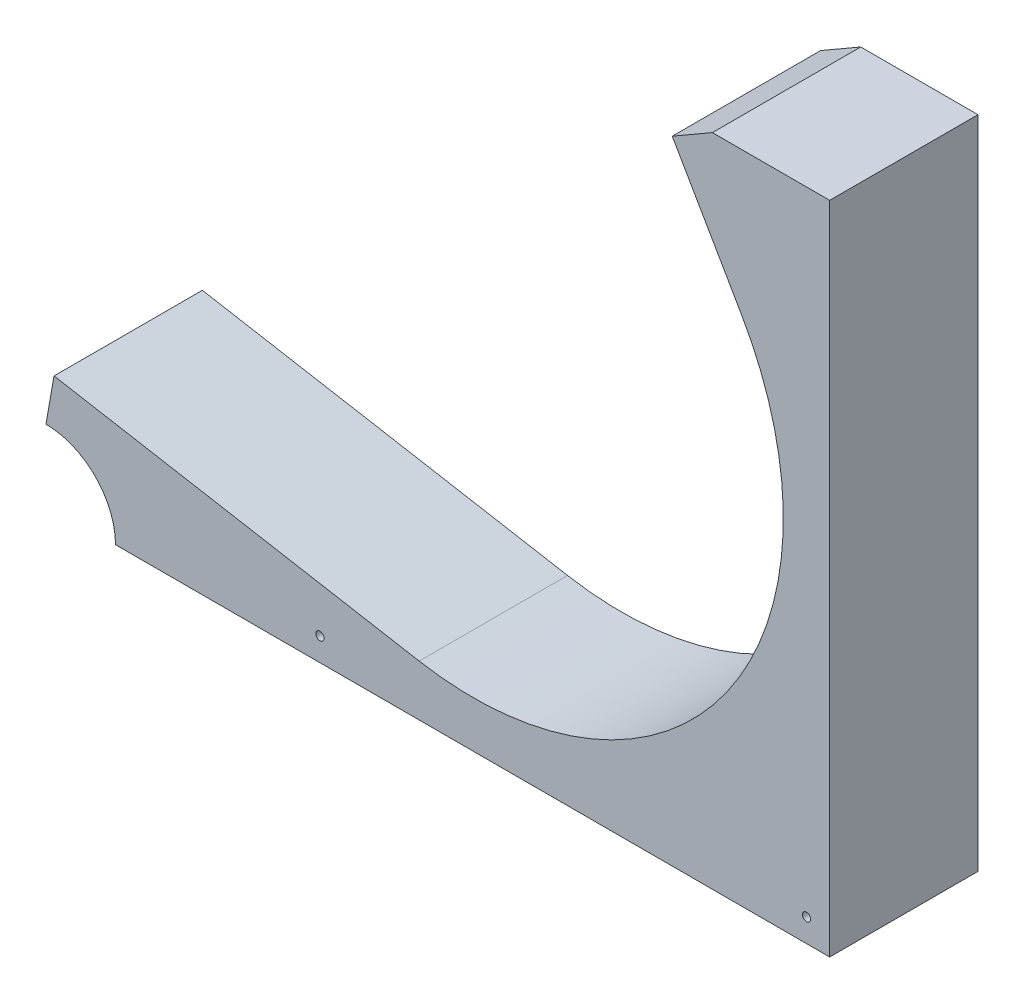
ISO-10303-21;
HEADER;
FILE_DESCRIPTION(('STEP AP214'),'2;1');
FILE_NAME('part.step','',(''),(''),'','','');
FILE_SCHEMA(('AUTOMOTIVE_DESIGN { 1 0 10303 214 1 1 1 1 }'));
ENDSEC;
DATA;
#1=APPLICATION_CONTEXT('core data for automotive mechanical design processes');
#2=APPLICATION_PROTOCOL_DEFINITION('international standard','automotive_design',2000,#1);
#3=PRODUCT_CONTEXT('',#1,'mechanical');
#4=PRODUCT('Part','Part','',(#3));
#5=PRODUCT_RELATED_PRODUCT_CATEGORY('part','',(#4));
#6=PRODUCT_DEFINITION_FORMATION('','',#4);
#7=PRODUCT_DEFINITION_CONTEXT('part definition',#1,'design');
#8=PRODUCT_DEFINITION('design','',#6,#7);
#9=PRODUCT_DEFINITION_SHAPE('','',#8);
#10=(LENGTH_UNIT() NAMED_UNIT(*) SI_UNIT(.MILLI.,.METRE.));
#11=(NAMED_UNIT(*) PLANE_ANGLE_UNIT() SI_UNIT($,.RADIAN.));
#12=(NAMED_UNIT(*) SI_UNIT($,.STERADIAN.) SOLID_ANGLE_UNIT());
#13=UNCERTAINTY_MEASURE_WITH_UNIT(LENGTH_MEASURE(1.E-05),#10,'distance_accuracy_value','');
#14=(GEOMETRIC_REPRESENTATION_CONTEXT(3) GLOBAL_UNCERTAINTY_ASSIGNED_CONTEXT((#13)) GLOBAL_UNIT_ASSIGNED_CONTEXT((#10,
#11,#12)) REPRESENTATION_CONTEXT('',''));
#15=CARTESIAN_POINT('',(0.,0.,0.));
#16=DIRECTION('',(0.,0.,1.));
#17=DIRECTION('',(1.,0.,0.));
#18=AXIS2_PLACEMENT_3D('',#15,#16,#17);
#19=CARTESIAN_POINT('',(-19.0500000000002,32.9955678841871,0.));
#20=DIRECTION('',(0.500000000000004,-0.866025403784437,0.));
#21=DIRECTION('',(0.866025403784437,0.500000000000004,0.));
#22=AXIS2_PLACEMENT_3D('',#19,#20,#21);
#23=PLANE('',#22);
#24=DIRECTION('',(0.,0.,1.));
#25=VECTOR('',#24,1.);
#26=CARTESIAN_POINT('',(65.5726331003115,81.8524678841875,-20.3199999999999));
#27=LINE('',#26,#25);
#28=CARTESIAN_POINT('',(65.5726331003115,81.8524678841875,-20.3200000000004));
#29=VERTEX_POINT('',#28);
#30=CARTESIAN_POINT('',(65.5726331003115,81.8524678841875,20.3199999999999));
#31=VERTEX_POINT('',#30);
#32=EDGE_CURVE('E184',#29,#31,#27,.T.);
#33=ORIENTED_EDGE('',*,*,#32,.F.);
#34=DIRECTION('',(0.866025403784437,0.500000000000003,0.));
#35=VECTOR('',#34,1.);
#36=CARTESIAN_POINT('',(65.5726331003115,81.8524678841875,-20.3199999999999));
#37=LINE('',#36,#35);
#38=CARTESIAN_POINT('',(54.5741104722492,75.5024678841874,-20.32));
#39=VERTEX_POINT('',#38);
#40=EDGE_CURVE('E211',#39,#29,#37,.T.);
#41=ORIENTED_EDGE('',*,*,#40,.F.);
#42=DIRECTION('',(0.,0.,-1.));
#43=VECTOR('',#42,1.);
#44=CARTESIAN_POINT('',(54.5741104722492,75.5024678841874,-20.32));
#45=LINE('',#44,#43);
#46=CARTESIAN_POINT('',(54.5741104722491,75.5024678841874,20.3200000000001));
#47=VERTEX_POINT('',#46);
#48=EDGE_CURVE('E206',#47,#39,#45,.T.);
#49=ORIENTED_EDGE('',*,*,#48,.F.);
#50=DIRECTION('',(-0.866025403784437,-0.500000000000004,0.));
#51=VECTOR('',#50,1.);
#52=CARTESIAN_POINT('',(65.5726331003115,81.8524678841874,20.3200000000001));
#53=LINE('',#52,#51);
#54=EDGE_CURVE('E186',#31,#47,#53,.T.);
#55=ORIENTED_EDGE('',*,*,#54,.F.);
#56=EDGE_LOOP('',(#33,#41,#49,#55));
#57=FACE_BOUND('',#56,.T.);
#58=ADVANCED_FACE('F76',(#57),#23,.F.);
#59=CARTESIAN_POINT('',(-100.05646770604,17.6426548509602,0.));
#60=DIRECTION('',(-0.984807753012208,0.173648177666931,0.));
#61=DIRECTION('',(-0.173648177666931,-0.984807753012208,0.));
#62=AXIS2_PLACEMENT_3D('',#59,#60,#61);
#63=PLANE('',#62);
#64=DIRECTION('',(0.,0.,1.));
#65=VECTOR('',#64,1.);
#66=CARTESIAN_POINT('',(-117.024291008951,-78.5866529653242,-20.3199999999999));
#67=LINE('',#66,#65);
#68=CARTESIAN_POINT('',(-117.024291008951,-78.5866529653242,-20.3199999999999));
#69=VERTEX_POINT('',#68);
#70=CARTESIAN_POINT('',(-117.024291008951,-78.5866529653241,20.3199999999999));
#71=VERTEX_POINT('',#70);
#72=EDGE_CURVE('E199',#69,#71,#67,.T.);
#73=ORIENTED_EDGE('',*,*,#72,.T.);
#74=DIRECTION('',(0.173648177666931,0.984807753012208,0.));
#75=VECTOR('',#74,1.);
#76=CARTESIAN_POINT('',(-117.024291008951,-78.5866529653241,20.3200000000001));
#77=LINE('',#76,#75);
#78=CARTESIAN_POINT('',(-114.818959152581,-66.0795945020691,20.3200000000001));
#79=VERTEX_POINT('',#78);
#80=EDGE_CURVE('E202',#71,#79,#77,.T.);
#81=ORIENTED_EDGE('',*,*,#80,.T.);
#82=DIRECTION('',(0.,0.,-1.));
#83=VECTOR('',#82,1.);
#84=CARTESIAN_POINT('',(-114.818959152581,-66.0795945020692,-20.32));
#85=LINE('',#84,#83);
#86=CARTESIAN_POINT('',(-114.818959152581,-66.0795945020692,-20.32));
#87=VERTEX_POINT('',#86);
#88=EDGE_CURVE('E97',#79,#87,#85,.T.);
#89=ORIENTED_EDGE('',*,*,#88,.T.);
#90=DIRECTION('',(-0.173648177666931,-0.984807753012208,0.));
#91=VECTOR('',#90,1.);
#92=CARTESIAN_POINT('',(-117.024291008951,-78.5866529653242,-20.3199999999999));
#93=LINE('',#92,#91);
#94=EDGE_CURVE('E83',#87,#69,#93,.T.);
#95=ORIENTED_EDGE('',*,*,#94,.T.);
#96=EDGE_LOOP('',(#73,#81,#89,#95));
#97=FACE_BOUND('',#96,.T.);
#98=ADVANCED_FACE('F246',(#97),#63,.T.);
#99=CARTESIAN_POINT('',(65.5726331003115,81.8524678841874,20.3200000000001));
#100=DIRECTION('',(0.,0.,1.));
#101=DIRECTION('',(1.,0.,0.));
#102=AXIS2_PLACEMENT_3D('',#99,#100,#101);
#103=PLANE('',#102);
#104=DIRECTION('',(-0.984807753012208,0.17364817766693,0.));
#105=VECTOR('',#104,1.);
#106=CARTESIAN_POINT('',(-14.7624914465408,-83.7222493530292,20.3200000000001));
#107=LINE('',#106,#105);
#108=CARTESIAN_POINT('',(-14.7624914465408,-83.7222493530292,20.3200000000001));
#109=VERTEX_POINT('',#108);
#110=EDGE_CURVE('E224',#109,#79,#107,.T.);
#111=ORIENTED_EDGE('',*,*,#110,.T.);
#112=ORIENTED_EDGE('',*,*,#80,.F.);
#113=DIRECTION('',(0.,-1.,0.));
#114=VECTOR('',#113,1.);
#115=CARTESIAN_POINT('',(-117.024291008951,0.,20.3199999999999));
#116=LINE('',#115,#114);
#117=CARTESIAN_POINT('',(-117.024291008951,-78.6637999999999,20.3199999999999));
#118=VERTEX_POINT('',#117);
#119=EDGE_CURVE('E178',#71,#118,#116,.T.);
#120=ORIENTED_EDGE('',*,*,#119,.T.);
#121=CARTESIAN_POINT('',(-117.024291008951,-97.7137999999999,20.3199999999999));
#122=DIRECTION('',(0.,0.,1.));
#123=DIRECTION('',(1.,0.,0.));
#124=AXIS2_PLACEMENT_3D('',#121,#122,#123);
#125=CIRCLE('',#124,19.05);
#126=CARTESIAN_POINT('',(-97.9742910089513,-97.7137999999999,20.3199999999999));
#127=VERTEX_POINT('',#126);
#128=EDGE_CURVE('E89',#127,#118,#125,.T.);
#129=ORIENTED_EDGE('',*,*,#128,.F.);
#130=DIRECTION('',(1.,0.,0.));
#131=VECTOR('',#130,1.);
#132=CARTESIAN_POINT('',(0.,-97.7137999999999,20.3199999999999));
#133=LINE('',#132,#131);
#134=CARTESIAN_POINT('',(97.7138,-97.7137999999999,20.3199999999999));
#135=VERTEX_POINT('',#134);
#136=EDGE_CURVE('E175',#127,#135,#133,.T.);
#137=ORIENTED_EDGE('',*,*,#136,.T.);
#138=DIRECTION('',(0.,1.,0.));
#139=VECTOR('',#138,1.);
#140=CARTESIAN_POINT('',(97.7138,0.,20.3199999999999));
#141=LINE('',#140,#139);
#142=CARTESIAN_POINT('',(97.7138,81.8524678841875,20.3199999999999));
#143=VERTEX_POINT('',#142);
#144=EDGE_CURVE('E191',#135,#143,#141,.T.);
#145=ORIENTED_EDGE('',*,*,#144,.T.);
#146=DIRECTION('',(-1.,0.,0.));
#147=VECTOR('',#146,1.);
#148=CARTESIAN_POINT('',(0.,81.8524678841875,20.3199999999999));
#149=LINE('',#148,#147);
#150=EDGE_CURVE('E274',#143,#31,#149,.T.);
#151=ORIENTED_EDGE('',*,*,#150,.T.);
#152=ORIENTED_EDGE('',*,*,#54,.T.);
#153=DIRECTION('',(0.500000000000004,-0.866025403784436,0.));
#154=VECTOR('',#153,1.);
#155=CARTESIAN_POINT('',(54.5741104722491,75.5024678841874,20.3200000000001));
#156=LINE('',#155,#154);
#157=CARTESIAN_POINT('',(73.6241104722492,42.5069000000003,20.3200000000001));
#158=VERTEX_POINT('',#157);
#159=EDGE_CURVE('E210',#47,#158,#156,.T.);
#160=ORIENTED_EDGE('',*,*,#159,.T.);
#161=CARTESIAN_POINT('',(0.,0.,20.3200000000001));
#162=DIRECTION('',(0.,0.,-1.));
#163=DIRECTION('',(0.866025403784436,0.500000000000004,0.));
#164=AXIS2_PLACEMENT_3D('',#161,#162,#163);
#165=CIRCLE('',#164,85.0137999999999);
#166=EDGE_CURVE('E218',#158,#109,#165,.T.);
#167=ORIENTED_EDGE('',*,*,#166,.T.);
#168=EDGE_LOOP('',(#111,#112,#120,#129,#137,#145,#151,#152,#160,#167));
#169=FACE_BOUND('',#168,.T.);
#170=CARTESIAN_POINT('',(91.3638000000004,-91.3638,20.3199999999999));
#171=DIRECTION('',(0.,0.,1.));
#172=DIRECTION('',(1.,0.,0.));
#173=AXIS2_PLACEMENT_3D('',#170,#171,#172);
#174=CIRCLE('',#173,1.1302999999995);
#175=CARTESIAN_POINT('',(92.4940999999999,-91.3638,20.3199999999999));
#176=VERTEX_POINT('',#175);
#177=EDGE_CURVE('E281',#176,#176,#174,.T.);
#178=ORIENTED_EDGE('',*,*,#177,.F.);
#179=EDGE_LOOP('',(#178));
#180=FACE_BOUND('',#179,.T.);
#181=CARTESIAN_POINT('',(-41.9734999999996,-91.3638,20.3199999999999));
#182=DIRECTION('',(0.,0.,1.));
#183=DIRECTION('',(1.,0.,0.));
#184=AXIS2_PLACEMENT_3D('',#181,#182,#183);
#185=CIRCLE('',#184,1.1302999999995);
#186=CARTESIAN_POINT('',(-40.8432000000001,-91.3638,20.3199999999999));
#187=VERTEX_POINT('',#186);
#188=EDGE_CURVE('E169',#187,#187,#185,.T.);
#189=ORIENTED_EDGE('',*,*,#188,.F.);
#190=EDGE_LOOP('',(#189));
#191=FACE_BOUND('',#190,.T.);
#192=ADVANCED_FACE('F173',(#169,#180,#191),#103,.T.);
#193=CARTESIAN_POINT('',(54.5741104722492,75.5024678841874,-20.32));
#194=DIRECTION('',(-0.866025403784436,-0.500000000000004,0.));
#195=DIRECTION('',(0.500000000000004,-0.866025403784436,0.));
#196=AXIS2_PLACEMENT_3D('',#193,#194,#195);
#197=PLANE('',#196);
#198=DIRECTION('',(0.500000000000004,-0.866025403784436,0.));
#199=VECTOR('',#198,1.);
#200=CARTESIAN_POINT('',(54.5741104722492,75.5024678841874,-20.32));
#201=LINE('',#200,#199);
#202=CARTESIAN_POINT('',(73.6241104722493,42.5069000000004,-20.32));
#203=VERTEX_POINT('',#202);
#204=EDGE_CURVE('E231',#39,#203,#201,.T.);
#205=ORIENTED_EDGE('',*,*,#204,.T.);
#206=DIRECTION('',(0.,0.,-1.));
#207=VECTOR('',#206,1.);
#208=CARTESIAN_POINT('',(73.6241104722493,42.5069000000004,-20.32));
#209=LINE('',#208,#207);
#210=EDGE_CURVE('E214',#158,#203,#209,.T.);
#211=ORIENTED_EDGE('',*,*,#210,.F.);
#212=ORIENTED_EDGE('',*,*,#159,.F.);
#213=ORIENTED_EDGE('',*,*,#48,.T.);
#214=EDGE_LOOP('',(#205,#211,#212,#213));
#215=FACE_BOUND('',#214,.T.);
#216=ADVANCED_FACE('F262',(#215),#197,.T.);
#217=CARTESIAN_POINT('',(65.5726331003115,81.8524678841875,-20.3199999999999));
#218=DIRECTION('',(0.,0.,-1.));
#219=DIRECTION('',(-1.,0.,0.));
#220=AXIS2_PLACEMENT_3D('',#217,#218,#219);
#221=PLANE('',#220);
#222=ORIENTED_EDGE('',*,*,#204,.F.);
#223=ORIENTED_EDGE('',*,*,#40,.T.);
#224=DIRECTION('',(-1.,0.,0.));
#225=VECTOR('',#224,1.);
#226=CARTESIAN_POINT('',(0.,81.8524678841875,-20.3200000000004));
#227=LINE('',#226,#225);
#228=CARTESIAN_POINT('',(97.7138,81.8524678841875,-20.3200000000003));
#229=VERTEX_POINT('',#228);
#230=EDGE_CURVE('E267',#229,#29,#227,.T.);
#231=ORIENTED_EDGE('',*,*,#230,.F.);
#232=DIRECTION('',(0.,1.,0.));
#233=VECTOR('',#232,1.);
#234=CARTESIAN_POINT('',(97.7138,3.34596504567019E-13,-20.3200000000002));
#235=LINE('',#234,#233);
#236=CARTESIAN_POINT('',(97.7138,-97.7137999999999,-20.32));
#237=VERTEX_POINT('',#236);
#238=EDGE_CURVE('E197',#237,#229,#235,.T.);
#239=ORIENTED_EDGE('',*,*,#238,.F.);
#240=DIRECTION('',(1.,0.,0.));
#241=VECTOR('',#240,1.);
#242=CARTESIAN_POINT('',(0.,-97.7137999999999,-20.3199999999999));
#243=LINE('',#242,#241);
#244=CARTESIAN_POINT('',(-97.9742910089513,-97.7137999999999,-20.3200000000004));
#245=VERTEX_POINT('',#244);
#246=EDGE_CURVE('E196',#245,#237,#243,.T.);
#247=ORIENTED_EDGE('',*,*,#246,.F.);
#248=CARTESIAN_POINT('',(-117.024291008951,-97.7137999999999,-20.3200000000004));
#249=DIRECTION('',(0.,0.,1.));
#250=DIRECTION('',(1.,0.,0.));
#251=AXIS2_PLACEMENT_3D('',#248,#249,#250);
#252=CIRCLE('',#251,19.05);
#253=CARTESIAN_POINT('',(-117.024291008951,-78.6637999999999,-20.3200000000004));
#254=VERTEX_POINT('',#253);
#255=EDGE_CURVE('E165',#245,#254,#252,.T.);
#256=ORIENTED_EDGE('',*,*,#255,.T.);
#257=DIRECTION('',(0.,-1.,0.));
#258=VECTOR('',#257,1.);
#259=CARTESIAN_POINT('',(-117.024291008951,3.34596504567019E-13,-20.3200000000001));
#260=LINE('',#259,#258);
#261=EDGE_CURVE('E188',#69,#254,#260,.T.);
#262=ORIENTED_EDGE('',*,*,#261,.F.);
#263=ORIENTED_EDGE('',*,*,#94,.F.);
#264=DIRECTION('',(-0.984807753012208,0.17364817766693,0.));
#265=VECTOR('',#264,1.);
#266=CARTESIAN_POINT('',(-14.7624914465408,-83.7222493530293,-20.32));
#267=LINE('',#266,#265);
#268=CARTESIAN_POINT('',(-14.7624914465408,-83.7222493530293,-20.32));
#269=VERTEX_POINT('',#268);
#270=EDGE_CURVE('E240',#269,#87,#267,.T.);
#271=ORIENTED_EDGE('',*,*,#270,.F.);
#272=CARTESIAN_POINT('',(0.,0.,-20.32));
#273=DIRECTION('',(0.,0.,-1.));
#274=DIRECTION('',(0.866025403784436,0.500000000000004,0.));
#275=AXIS2_PLACEMENT_3D('',#272,#273,#274);
#276=CIRCLE('',#275,85.0138);
#277=EDGE_CURVE('E236',#203,#269,#276,.T.);
#278=ORIENTED_EDGE('',*,*,#277,.F.);
#279=EDGE_LOOP('',(#222,#223,#231,#239,#247,#256,#262,#263,#271,#278));
#280=FACE_BOUND('',#279,.T.);
#281=CARTESIAN_POINT('',(91.3638000000004,-91.3638,-20.3200000000004));
#282=DIRECTION('',(0.,0.,1.));
#283=DIRECTION('',(1.,0.,0.));
#284=AXIS2_PLACEMENT_3D('',#281,#282,#283);
#285=CIRCLE('',#284,1.1302999999995);
#286=CARTESIAN_POINT('',(92.4940999999999,-91.3638,-20.3200000000004));
#287=VERTEX_POINT('',#286);
#288=EDGE_CURVE('E277',#287,#287,#285,.T.);
#289=ORIENTED_EDGE('',*,*,#288,.T.);
#290=EDGE_LOOP('',(#289));
#291=FACE_BOUND('',#290,.T.);
#292=CARTESIAN_POINT('',(-41.9734999999996,-91.3638,-20.3200000000004));
#293=DIRECTION('',(0.,0.,1.));
#294=DIRECTION('',(1.,0.,0.));
#295=AXIS2_PLACEMENT_3D('',#292,#293,#294);
#296=CIRCLE('',#295,1.1302999999995);
#297=CARTESIAN_POINT('',(-40.8432000000001,-91.3638,-20.3200000000004));
#298=VERTEX_POINT('',#297);
#299=EDGE_CURVE('E444',#298,#298,#296,.T.);
#300=ORIENTED_EDGE('',*,*,#299,.T.);
#301=EDGE_LOOP('',(#300));
#302=FACE_BOUND('',#301,.T.);
#303=ADVANCED_FACE('F249',(#280,#291,#302),#221,.T.);
#304=CARTESIAN_POINT('',(0.,0.,0.));
#305=DIRECTION('',(0.,0.,-1.));
#306=DIRECTION('',(-1.,0.,0.));
#307=AXIS2_PLACEMENT_3D('',#304,#305,#306);
#308=CYLINDRICAL_SURFACE('',#307,85.0138);
#309=ORIENTED_EDGE('',*,*,#277,.T.);
#310=DIRECTION('',(0.,0.,-1.));
#311=VECTOR('',#310,1.);
#312=CARTESIAN_POINT('',(-14.7624914465408,-83.7222493530292,-20.32));
#313=LINE('',#312,#311);
#314=EDGE_CURVE('E222',#109,#269,#313,.T.);
#315=ORIENTED_EDGE('',*,*,#314,.F.);
#316=ORIENTED_EDGE('',*,*,#166,.F.);
#317=ORIENTED_EDGE('',*,*,#210,.T.);
#318=EDGE_LOOP('',(#309,#315,#316,#317));
#319=FACE_BOUND('',#318,.T.);
#320=ADVANCED_FACE('F256',(#319),#308,.F.);
#321=CARTESIAN_POINT('',(-14.7624914465408,-83.7222493530293,-20.32));
#322=DIRECTION('',(0.17364817766693,0.984807753012208,0.));
#323=DIRECTION('',(-0.984807753012208,0.17364817766693,0.));
#324=AXIS2_PLACEMENT_3D('',#321,#322,#323);
#325=PLANE('',#324);
#326=ORIENTED_EDGE('',*,*,#270,.T.);
#327=ORIENTED_EDGE('',*,*,#88,.F.);
#328=ORIENTED_EDGE('',*,*,#110,.F.);
#329=ORIENTED_EDGE('',*,*,#314,.T.);
#330=EDGE_LOOP('',(#326,#327,#328,#329));
#331=FACE_BOUND('',#330,.T.);
#332=ADVANCED_FACE('F253',(#331),#325,.T.);
#333=CARTESIAN_POINT('',(0.,-97.7137999999999,-158.508181191012));
#334=DIRECTION('',(0.,-1.,0.));
#335=DIRECTION('',(0.,0.,-1.));
#336=AXIS2_PLACEMENT_3D('',#333,#334,#335);
#337=PLANE('',#336);
#338=DIRECTION('',(0.,0.,1.));
#339=VECTOR('',#338,1.);
#340=CARTESIAN_POINT('',(-97.9742910089513,-97.7137999999999,-20.3200000000004));
#341=LINE('',#340,#339);
#342=EDGE_CURVE('E162',#245,#127,#341,.T.);
#343=ORIENTED_EDGE('',*,*,#342,.F.);
#344=ORIENTED_EDGE('',*,*,#246,.T.);
#345=DIRECTION('',(0.,0.,1.));
#346=VECTOR('',#345,1.);
#347=CARTESIAN_POINT('',(97.7138,-97.7137999999999,-158.508181191012));
#348=LINE('',#347,#346);
#349=EDGE_CURVE('E182',#237,#135,#348,.T.);
#350=ORIENTED_EDGE('',*,*,#349,.T.);
#351=ORIENTED_EDGE('',*,*,#136,.F.);
#352=EDGE_LOOP('',(#343,#344,#350,#351));
#353=FACE_BOUND('',#352,.T.);
#354=ADVANCED_FACE('F180',(#353),#337,.T.);
#355=CARTESIAN_POINT('',(-117.024291008951,0.,-158.508181191012));
#356=DIRECTION('',(-1.,0.,0.));
#357=DIRECTION('',(0.,0.,1.));
#358=AXIS2_PLACEMENT_3D('',#355,#356,#357);
#359=PLANE('',#358);
#360=DIRECTION('',(0.,0.,1.));
#361=VECTOR('',#360,1.);
#362=CARTESIAN_POINT('',(-117.024291008951,-78.6637999999999,-20.3200000000004));
#363=LINE('',#362,#361);
#364=EDGE_CURVE('E12',#118,#254,#363,.F.);
#365=ORIENTED_EDGE('',*,*,#364,.F.);
#366=ORIENTED_EDGE('',*,*,#119,.F.);
#367=ORIENTED_EDGE('',*,*,#72,.F.);
#368=ORIENTED_EDGE('',*,*,#261,.T.);
#369=EDGE_LOOP('',(#365,#366,#367,#368));
#370=FACE_BOUND('',#369,.T.);
#371=ADVANCED_FACE('F289',(#370),#359,.T.);
#372=CARTESIAN_POINT('',(97.7138,0.,-158.508181191012));
#373=DIRECTION('',(1.,0.,0.));
#374=DIRECTION('',(0.,0.,-1.));
#375=AXIS2_PLACEMENT_3D('',#372,#373,#374);
#376=PLANE('',#375);
#377=ORIENTED_EDGE('',*,*,#349,.F.);
#378=ORIENTED_EDGE('',*,*,#238,.T.);
#379=DIRECTION('',(0.,0.,1.));
#380=VECTOR('',#379,1.);
#381=CARTESIAN_POINT('',(97.7138,81.8524678841875,-158.508181191012));
#382=LINE('',#381,#380);
#383=EDGE_CURVE('E276',#229,#143,#382,.T.);
#384=ORIENTED_EDGE('',*,*,#383,.T.);
#385=ORIENTED_EDGE('',*,*,#144,.F.);
#386=EDGE_LOOP('',(#377,#378,#384,#385));
#387=FACE_BOUND('',#386,.T.);
#388=ADVANCED_FACE('F286',(#387),#376,.T.);
#389=CARTESIAN_POINT('',(0.,81.8524678841875,-158.508181191012));
#390=DIRECTION('',(0.,1.,0.));
#391=DIRECTION('',(0.,0.,1.));
#392=AXIS2_PLACEMENT_3D('',#389,#390,#391);
#393=PLANE('',#392);
#394=ORIENTED_EDGE('',*,*,#383,.F.);
#395=ORIENTED_EDGE('',*,*,#230,.T.);
#396=ORIENTED_EDGE('',*,*,#32,.T.);
#397=ORIENTED_EDGE('',*,*,#150,.F.);
#398=EDGE_LOOP('',(#394,#395,#396,#397));
#399=FACE_BOUND('',#398,.T.);
#400=ADVANCED_FACE('F273',(#399),#393,.T.);
#401=CARTESIAN_POINT('',(-41.9734999999996,-91.3638,-20.3200000000004));
#402=DIRECTION('',(0.,0.,1.));
#403=DIRECTION('',(1.,0.,0.));
#404=AXIS2_PLACEMENT_3D('',#401,#402,#403);
#405=CYLINDRICAL_SURFACE('',#404,1.1302999999995);
#406=ORIENTED_EDGE('',*,*,#299,.F.);
#407=EDGE_LOOP('',(#406));
#408=FACE_BOUND('',#407,.T.);
#409=ORIENTED_EDGE('',*,*,#188,.T.);
#410=EDGE_LOOP('',(#409));
#411=FACE_BOUND('',#410,.T.);
#412=ADVANCED_FACE('F339',(#408,#411),#405,.F.);
#413=CARTESIAN_POINT('',(91.3638000000004,-91.3638,-20.3200000000004));
#414=DIRECTION('',(0.,0.,1.));
#415=DIRECTION('',(1.,0.,0.));
#416=AXIS2_PLACEMENT_3D('',#413,#414,#415);
#417=CYLINDRICAL_SURFACE('',#416,1.1302999999995);
#418=ORIENTED_EDGE('',*,*,#288,.F.);
#419=EDGE_LOOP('',(#418));
#420=FACE_BOUND('',#419,.T.);
#421=ORIENTED_EDGE('',*,*,#177,.T.);
#422=EDGE_LOOP('',(#421));
#423=FACE_BOUND('',#422,.T.);
#424=ADVANCED_FACE('F348',(#420,#423),#417,.F.);
#425=CARTESIAN_POINT('',(-117.024291008951,-97.7137999999999,-20.3200000000004));
#426=DIRECTION('',(0.,0.,1.));
#427=DIRECTION('',(1.,0.,0.));
#428=AXIS2_PLACEMENT_3D('',#425,#426,#427);
#429=CYLINDRICAL_SURFACE('',#428,19.05);
#430=ORIENTED_EDGE('',*,*,#342,.T.);
#431=ORIENTED_EDGE('',*,*,#128,.T.);
#432=ORIENTED_EDGE('',*,*,#364,.T.);
#433=ORIENTED_EDGE('',*,*,#255,.F.);
#434=EDGE_LOOP('',(#430,#431,#432,#433));
#435=FACE_BOUND('',#434,.T.);
#436=ADVANCED_FACE('F163',(#435),#429,.F.);
#437=CLOSED_SHELL('',(#58,#98,#192,#216,#303,#320,#332,#354,#371,#388,#400,#412,#424,#436));
#438=MANIFOLD_SOLID_BREP('B2',#437);
#439=ADVANCED_BREP_SHAPE_REPRESENTATION('',(#18,#438),#14);
#440=SHAPE_DEFINITION_REPRESENTATION(#9,#439);
ENDSEC;
END-ISO-10303-21;
